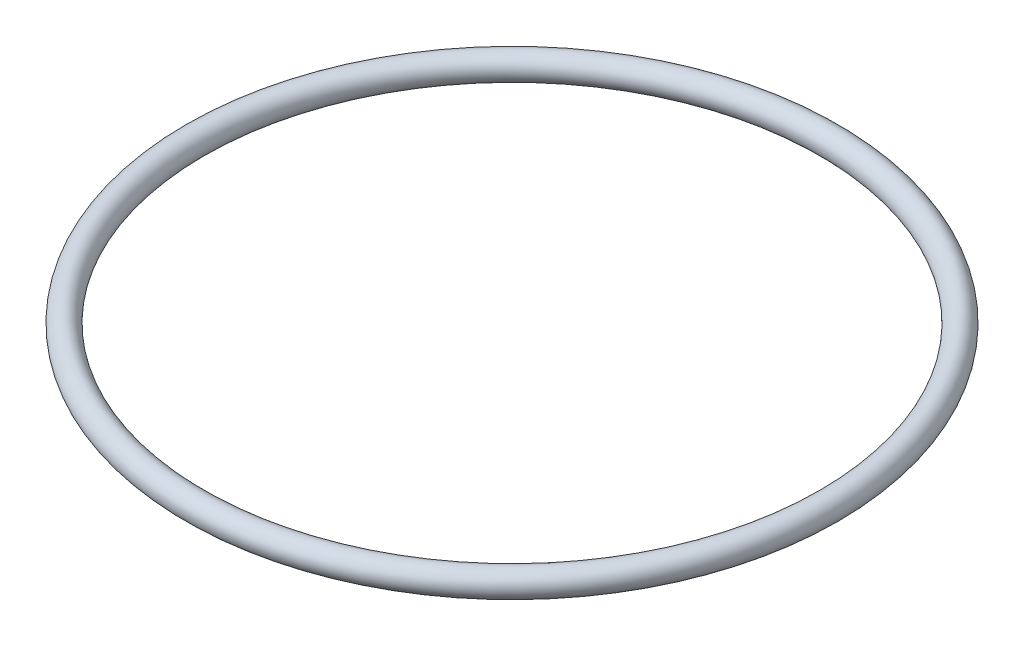
ISO-10303-21;
HEADER;
FILE_DESCRIPTION(('STEP AP214'),'2;1');
FILE_NAME('part.step','',(''),(''),'','','');
FILE_SCHEMA(('AUTOMOTIVE_DESIGN { 1 0 10303 214 1 1 1 1 }'));
ENDSEC;
DATA;
#1=APPLICATION_CONTEXT('core data for automotive mechanical design processes');
#2=APPLICATION_PROTOCOL_DEFINITION('international standard','automotive_design',2000,#1);
#3=PRODUCT_CONTEXT('',#1,'mechanical');
#4=PRODUCT('Part','Part','',(#3));
#5=PRODUCT_RELATED_PRODUCT_CATEGORY('part','',(#4));
#6=PRODUCT_DEFINITION_FORMATION('','',#4);
#7=PRODUCT_DEFINITION_CONTEXT('part definition',#1,'design');
#8=PRODUCT_DEFINITION('design','',#6,#7);
#9=PRODUCT_DEFINITION_SHAPE('','',#8);
#10=(LENGTH_UNIT() NAMED_UNIT(*) SI_UNIT(.MILLI.,.METRE.));
#11=(NAMED_UNIT(*) PLANE_ANGLE_UNIT() SI_UNIT($,.RADIAN.));
#12=(NAMED_UNIT(*) SI_UNIT($,.STERADIAN.) SOLID_ANGLE_UNIT());
#13=UNCERTAINTY_MEASURE_WITH_UNIT(LENGTH_MEASURE(1.E-05),#10,'distance_accuracy_value','');
#14=(GEOMETRIC_REPRESENTATION_CONTEXT(3) GLOBAL_UNCERTAINTY_ASSIGNED_CONTEXT((#13)) GLOBAL_UNIT_ASSIGNED_CONTEXT((#10,
#11,#12)) REPRESENTATION_CONTEXT('',''));
#15=CARTESIAN_POINT('',(0.,0.,0.));
#16=DIRECTION('',(0.,0.,1.));
#17=DIRECTION('',(1.,0.,0.));
#18=AXIS2_PLACEMENT_3D('',#15,#16,#17);
#19=CARTESIAN_POINT('',(0.,0.,0.));
#20=DIRECTION('',(0.,1.,0.));
#21=DIRECTION('',(0.,0.,1.));
#22=AXIS2_PLACEMENT_3D('',#19,#20,#21);
#23=TOROIDAL_SURFACE('',#22,32.3,1.3);
#24=CARTESIAN_POINT('',(-32.3,0.,0.));
#25=DIRECTION('',(0.,0.,1.));
#26=DIRECTION('',(1.,0.,0.));
#27=AXIS2_PLACEMENT_3D('',#24,#25,#26);
#28=CIRCLE('',#27,1.3);
#29=CARTESIAN_POINT('',(-33.6,0.,0.));
#30=VERTEX_POINT('',#29);
#31=EDGE_CURVE('E10',#30,#30,#28,.T.);
#32=CARTESIAN_POINT('',(0.,0.,0.));
#33=DIRECTION('',(0.,1.,0.));
#34=DIRECTION('',(0.,0.,1.));
#35=AXIS2_PLACEMENT_3D('',#32,#33,#34);
#36=CIRCLE('',#35,33.6);
#37=EDGE_CURVE('',#30,#30,#36,.T.);
#38=ORIENTED_EDGE('',*,*,#31,.T.);
#39=ORIENTED_EDGE('',*,*,#31,.F.);
#40=ORIENTED_EDGE('',*,*,#37,.T.);
#41=ORIENTED_EDGE('',*,*,#37,.F.);
#42=EDGE_LOOP('',(#38,#40,#39,#41));
#43=FACE_BOUND('',#42,.T.);
#44=ADVANCED_FACE('F32',(#43),#23,.T.);
#45=CLOSED_SHELL('',(#44));
#46=MANIFOLD_SOLID_BREP('B2',#45);
#47=ADVANCED_BREP_SHAPE_REPRESENTATION('',(#18,#46),#14);
#48=SHAPE_DEFINITION_REPRESENTATION(#9,#47);
ENDSEC;
END-ISO-10303-21;
